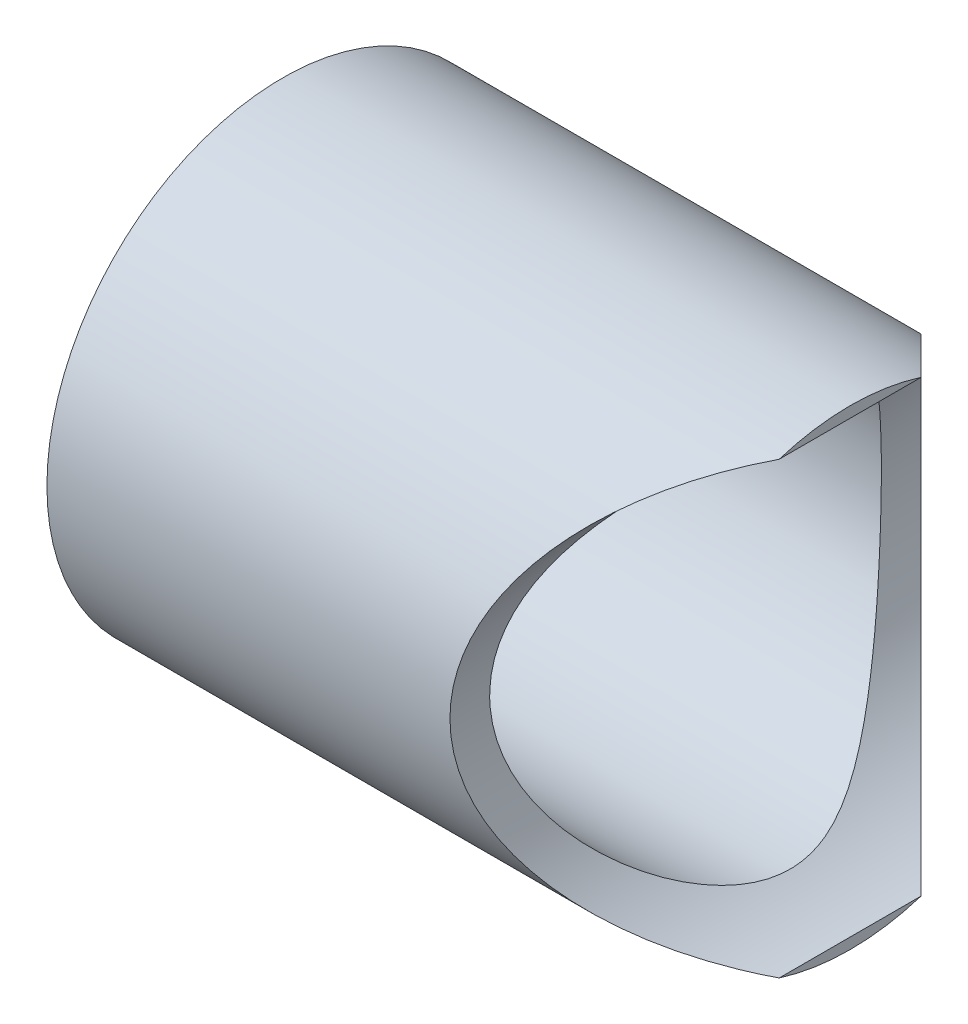
ISO-10303-21;
HEADER;
FILE_DESCRIPTION(('STEP AP214'),'2;1');
FILE_NAME('part.step','',(''),(''),'','','');
FILE_SCHEMA(('AUTOMOTIVE_DESIGN { 1 0 10303 214 1 1 1 1 }'));
ENDSEC;
DATA;
#1=APPLICATION_CONTEXT('core data for automotive mechanical design processes');
#2=APPLICATION_PROTOCOL_DEFINITION('international standard','automotive_design',2000,#1);
#3=PRODUCT_CONTEXT('',#1,'mechanical');
#4=PRODUCT('Part','Part','',(#3));
#5=PRODUCT_RELATED_PRODUCT_CATEGORY('part','',(#4));
#6=PRODUCT_DEFINITION_FORMATION('','',#4);
#7=PRODUCT_DEFINITION_CONTEXT('part definition',#1,'design');
#8=PRODUCT_DEFINITION('design','',#6,#7);
#9=PRODUCT_DEFINITION_SHAPE('','',#8);
#10=(LENGTH_UNIT() NAMED_UNIT(*) SI_UNIT(.MILLI.,.METRE.));
#11=(NAMED_UNIT(*) PLANE_ANGLE_UNIT() SI_UNIT($,.RADIAN.));
#12=(NAMED_UNIT(*) SI_UNIT($,.STERADIAN.) SOLID_ANGLE_UNIT());
#13=UNCERTAINTY_MEASURE_WITH_UNIT(LENGTH_MEASURE(1.E-05),#10,'distance_accuracy_value','');
#14=(GEOMETRIC_REPRESENTATION_CONTEXT(3) GLOBAL_UNCERTAINTY_ASSIGNED_CONTEXT((#13)) GLOBAL_UNIT_ASSIGNED_CONTEXT((#10,
#11,#12)) REPRESENTATION_CONTEXT('',''));
#15=CARTESIAN_POINT('',(0.,0.,0.));
#16=DIRECTION('',(0.,0.,1.));
#17=DIRECTION('',(1.,0.,0.));
#18=AXIS2_PLACEMENT_3D('',#15,#16,#17);
#19=CARTESIAN_POINT('',(568.325,28.575,31.75));
#20=DIRECTION('',(1.,0.,0.));
#21=DIRECTION('',(0.,0.,-1.));
#22=AXIS2_PLACEMENT_3D('',#19,#20,#21);
#23=CYLINDRICAL_SURFACE('',#22,17.526);
#24=CARTESIAN_POINT('',(517.525,28.575,31.75));
#25=DIRECTION('',(1.,0.,0.));
#26=DIRECTION('',(0.,0.,-1.));
#27=AXIS2_PLACEMENT_3D('',#24,#25,#26);
#28=CIRCLE('',#27,17.526);
#29=CARTESIAN_POINT('',(517.525,28.575,14.224));
#30=VERTEX_POINT('',#29);
#31=EDGE_CURVE('E50',#30,#30,#28,.F.);
#32=ORIENTED_EDGE('',*,*,#31,.T.);
#33=EDGE_LOOP('',(#32));
#34=FACE_BOUND('',#33,.T.);
#35=CARTESIAN_POINT('',(553.6132342657,27.651553554921,49.2516549780933));
#36=CARTESIAN_POINT('',(553.63194520487,27.2248883758585,49.2291386511275));
#37=CARTESIAN_POINT('',(553.663610725579,26.7995434640195,49.1910242975839));
#38=CARTESIAN_POINT('',(553.752104841597,25.9551538969348,49.0843120614281));
#39=CARTESIAN_POINT('',(553.808948425233,25.5361131483769,49.0156960212857));
#40=CARTESIAN_POINT('',(553.946600456313,24.7070400392876,48.8490849594317));
#41=CARTESIAN_POINT('',(554.027457627212,24.2970278321291,48.7510302022475));
#42=CARTESIAN_POINT('',(554.211300770934,23.4898151176844,48.527276357537));
#43=CARTESIAN_POINT('',(554.314283998306,23.0926130279163,48.4015806997103));
#44=CARTESIAN_POINT('',(554.539434674483,22.3162582315454,48.1255083294046));
#45=CARTESIAN_POINT('',(554.661447416689,21.9369895887925,47.9753302440843));
#46=CARTESIAN_POINT('',(554.92303896723,21.1949212814434,47.6515413924575));
#47=CARTESIAN_POINT('',(555.062617896931,20.8321217306566,47.4779304642516));
#48=CARTESIAN_POINT('',(555.357071377504,20.1242436265884,47.1091874654224));
#49=CARTESIAN_POINT('',(555.511942875587,19.7791615572673,46.9140596892073));
#50=CARTESIAN_POINT('',(555.834786549205,19.1073688486667,46.5039680266759));
#51=CARTESIAN_POINT('',(556.002761479555,18.780662097528,46.2889999674621));
#52=CARTESIAN_POINT('',(556.417437189112,18.0220383365813,45.7531298265484));
#53=CARTESIAN_POINT('',(556.669242607125,17.5989227834955,45.4236685216113));
#54=CARTESIAN_POINT('',(557.188161904108,16.7897380298934,44.7327405120847));
#55=CARTESIAN_POINT('',(557.455281581414,16.4036830113015,44.3712616562967));
#56=CARTESIAN_POINT('',(557.999542924498,15.6680400337881,43.6179753752106));
#57=CARTESIAN_POINT('',(558.276705238362,15.3185337076634,43.2261033255249));
#58=CARTESIAN_POINT('',(558.834279074004,14.6570525248326,42.4142205291842));
#59=CARTESIAN_POINT('',(559.11468983232,14.3450690379657,41.9942162875962));
#60=CARTESIAN_POINT('',(559.632011572531,13.8007185942458,41.1883641337813));
#61=CARTESIAN_POINT('',(559.869415567063,13.5633444865263,40.8062049143649));
#62=CARTESIAN_POINT('',(560.336291867032,13.1167833955921,40.0209297923646));
#63=CARTESIAN_POINT('',(560.565762786849,12.9076013181969,39.617810259254));
#64=CARTESIAN_POINT('',(561.009597244897,12.5190276239062,38.7909265661388));
#65=CARTESIAN_POINT('',(561.223997027915,12.3395630224724,38.3672163919916));
#66=CARTESIAN_POINT('',(561.629877023419,12.0116838635953,37.4974307300209));
#67=CARTESIAN_POINT('',(561.821372397404,11.8632487170933,37.0513703174964));
#68=CARTESIAN_POINT('',(562.10238022292,11.6517094609978,36.3158189708982));
#69=CARTESIAN_POINT('',(562.202466650341,11.5779501485683,36.0334054398798));
#70=CARTESIAN_POINT('',(562.387406449853,11.4437769399667,35.4605730507806));
#71=CARTESIAN_POINT('',(562.472265291171,11.3833582504955,35.1701571102972));
#72=CARTESIAN_POINT('',(562.623719926992,11.2768510445484,34.5826056062547));
#73=CARTESIAN_POINT('',(562.690351854318,11.2307341517171,34.2854846199364));
#74=CARTESIAN_POINT('',(562.802812907537,11.153559923682,33.6853537317127));
#75=CARTESIAN_POINT('',(562.848642594221,11.1225021825086,33.3823439887875));
#76=CARTESIAN_POINT('',(562.917618597342,11.0759576435487,32.7695518417688));
#77=CARTESIAN_POINT('',(562.940542440761,11.0606235246119,32.4597323258211));
#78=CARTESIAN_POINT('',(562.961686457704,11.0464752489036,31.8388774861906));
#79=CARTESIAN_POINT('',(562.959907912927,11.0476602350271,31.5278422264246));
#80=CARTESIAN_POINT('',(562.931737791119,11.066522239054,30.9071721607201));
#81=CARTESIAN_POINT('',(562.905327611075,11.0842117219626,30.5975385910324));
#82=CARTESIAN_POINT('',(562.829287785697,11.1356221445223,29.9824960146836));
#83=CARTESIAN_POINT('',(562.779654559099,11.1693455568054,29.6770876670826));
#84=CARTESIAN_POINT('',(562.648964561793,11.2593267827706,29.0192684622872));
#85=CARTESIAN_POINT('',(562.563912440033,11.3185077514551,28.6680552454522));
#86=CARTESIAN_POINT('',(562.369714116579,11.4564489198208,27.9763557783634));
#87=CARTESIAN_POINT('',(562.260561787034,11.5352140997343,27.6358722815128));
#88=CARTESIAN_POINT('',(562.022670875519,11.7110977346963,26.9656652776438));
#89=CARTESIAN_POINT('',(561.893879122912,11.8082661919802,26.6359740246218));
#90=CARTESIAN_POINT('',(561.621321691653,12.019578309619,25.9885187714624));
#91=CARTESIAN_POINT('',(561.477555053138,12.1337230583244,25.6707555376675));
#92=CARTESIAN_POINT('',(561.092030360477,12.4490441504447,24.8656000598379));
#93=CARTESIAN_POINT('',(560.841869054055,12.662255199984,24.3869171130996));
#94=CARTESIAN_POINT('',(560.325413057825,13.1263464140542,23.4572406747958));
#95=CARTESIAN_POINT('',(560.059109583728,13.3772472004749,23.0062625333938));
#96=CARTESIAN_POINT('',(559.519003931967,13.9157993131414,22.1305941430946));
#97=CARTESIAN_POINT('',(559.245192679099,14.2034968092985,21.7059379323097));
#98=CARTESIAN_POINT('',(558.697610994296,14.814832161151,20.883495621219));
#99=CARTESIAN_POINT('',(558.423840564891,15.1384629546108,20.4857042655945));
#100=CARTESIAN_POINT('',(557.872486123842,15.8341072768717,19.7036710781982));
#101=CARTESIAN_POINT('',(557.595127555098,16.2074554775149,19.3204535192804));
#102=CARTESIAN_POINT('',(557.053147217793,16.9927394643263,18.5856108378869));
#103=CARTESIAN_POINT('',(556.78852764483,17.4046818665104,18.2339911523956));
#104=CARTESIAN_POINT('',(556.278735946374,18.2658875770049,17.566247661421));
#105=CARTESIAN_POINT('',(556.033518005512,18.7150575018147,17.2500394528144));
#106=CARTESIAN_POINT('',(555.684541741303,19.4163188768659,16.8049043481796));
#107=CARTESIAN_POINT('',(555.571372631905,19.6546217657447,16.6614069120782));
#108=CARTESIAN_POINT('',(555.352015446805,20.1403100336688,16.384622710406));
#109=CARTESIAN_POINT('',(555.245829019299,20.387697535729,16.2513383543187));
#110=CARTESIAN_POINT('',(555.000724302809,20.9909703069177,15.9449832838891));
#111=CARTESIAN_POINT('',(554.865504638994,21.3510115435203,15.7770694459881));
#112=CARTESIAN_POINT('',(554.612468644417,22.0867901817555,15.464314302072));
#113=CARTESIAN_POINT('',(554.494647792276,22.4625234728666,15.319467001054));
#114=CARTESIAN_POINT('',(554.278486111934,23.2279462607528,15.0546840261331));
#115=CARTESIAN_POINT('',(554.180136041326,23.6176290317467,14.93473653145));
#116=CARTESIAN_POINT('',(554.004758658889,24.4089395054123,14.7214205670362));
#117=CARTESIAN_POINT('',(553.927731902221,24.8105675187823,14.6280527893188));
#118=CARTESIAN_POINT('',(553.796242064935,25.6255022994865,14.4689553147246));
#119=CARTESIAN_POINT('',(553.741917605387,26.0388648166705,14.4033953782027));
#120=CARTESIAN_POINT('',(553.657753481508,26.8717012490999,14.3019225005657));
#121=CARTESIAN_POINT('',(553.62791377489,27.2911751537893,14.2660095082485));
#122=CARTESIAN_POINT('',(553.593438891844,28.1325659071852,14.2245241417152));
#123=CARTESIAN_POINT('',(553.588798137691,28.5544821945765,14.2189450531651));
#124=CARTESIAN_POINT('',(553.604822338428,29.3971171081654,14.238221976866));
#125=CARTESIAN_POINT('',(553.62548566314,29.8178358097656,14.2630760285077));
#126=CARTESIAN_POINT('',(553.688561885376,30.6159230296238,14.3390570919547));
#127=CARTESIAN_POINT('',(553.728799395593,30.9937194250997,14.3875571914303));
#128=CARTESIAN_POINT('',(553.828929712951,31.7427812450289,14.5084876261824));
#129=CARTESIAN_POINT('',(553.888821064225,32.1140471510855,14.5809161889501));
#130=CARTESIAN_POINT('',(554.027171891085,32.8478640262592,14.7486763247663));
#131=CARTESIAN_POINT('',(554.105633783347,33.21041385434,14.8440108787088));
#132=CARTESIAN_POINT('',(554.279783315149,33.9248674991795,15.0563334639198));
#133=CARTESIAN_POINT('',(554.375471946737,34.2767707014591,15.1733227422459));
#134=CARTESIAN_POINT('',(554.587686804472,34.9854655883075,15.4338700258972));
#135=CARTESIAN_POINT('',(554.705008685464,35.3416405381561,15.5784547566227));
#136=CARTESIAN_POINT('',(554.955115211802,36.0391932726221,15.8883425772297));
#137=CARTESIAN_POINT('',(555.087899920564,36.3805709965455,16.0536457520818));
#138=CARTESIAN_POINT('',(555.367046494505,37.0475647296724,16.4034001140339));
#139=CARTESIAN_POINT('',(555.513408197233,37.3731809273932,16.5878510720319));
#140=CARTESIAN_POINT('',(555.817842140174,38.0080442128939,16.9744614103544));
#141=CARTESIAN_POINT('',(555.975916710006,38.3172880232222,17.1766243149436));
#142=CARTESIAN_POINT('',(556.378205331234,39.0597598160948,17.6957887790924));
#143=CARTESIAN_POINT('',(556.628123801946,39.4833160904538,18.0222722641879));
#144=CARTESIAN_POINT('',(557.143476858452,40.293667724244,18.707178477193));
#145=CARTESIAN_POINT('',(557.408917656656,40.6804482002274,19.065614023602));
#146=CARTESIAN_POINT('',(557.950651241676,41.4185696710951,19.8134758321493));
#147=CARTESIAN_POINT('',(558.226985186979,41.7697538179874,20.2030267848256));
#148=CARTESIAN_POINT('',(558.783282553626,42.4347211063088,21.0102486787129));
#149=CARTESIAN_POINT('',(559.063245346979,42.7485106257462,21.4279148055433));
#150=CARTESIAN_POINT('',(559.625039046534,43.3438829297906,22.2988544801849));
#151=CARTESIAN_POINT('',(559.906811272405,43.6247758999827,22.7526376007069));
#152=CARTESIAN_POINT('',(560.458476862686,44.1469381906453,23.6900082577224));
#153=CARTESIAN_POINT('',(560.728363228186,44.3881843878375,24.1736129626194));
#154=CARTESIAN_POINT('',(561.11459737276,44.7179489663259,24.9207034971405));
#155=CARTESIAN_POINT('',(561.239928719899,44.8222804520434,25.1726371069145));
#156=CARTESIAN_POINT('',(561.482889061811,45.0201661238956,25.6843157565484));
#157=CARTESIAN_POINT('',(561.600517366609,45.113719345169,25.9440614931227));
#158=CARTESIAN_POINT('',(561.938532613595,45.3772129267124,26.7345969811832));
#159=CARTESIAN_POINT('',(562.144573565655,45.5304248798187,27.2776663439232));
#160=CARTESIAN_POINT('',(562.408721562727,45.7214547675609,28.1113403675845));
#161=CARTESIAN_POINT('',(562.488946350962,45.7784454842204,28.3907307055577));
#162=CARTESIAN_POINT('',(562.632545549384,45.8792680200227,28.9561877305163));
#163=CARTESIAN_POINT('',(562.695922688387,45.9231019703183,29.2422533281339));
#164=CARTESIAN_POINT('',(562.803266107254,45.9967369819232,29.8191654017346));
#165=CARTESIAN_POINT('',(562.847274457066,46.0265684667391,30.1100000784278));
#166=CARTESIAN_POINT('',(562.914128823784,46.0716933051478,30.6952451785392));
#167=CARTESIAN_POINT('',(562.936975128598,46.0869868565273,30.9896555532553));
#168=CARTESIAN_POINT('',(562.960445793863,46.1026967996271,31.5812183700857));
#169=CARTESIAN_POINT('',(562.960960707175,46.1030399186543,31.8783771794665));
#170=CARTESIAN_POINT('',(562.939466250044,46.0886555348839,32.4714956001306));
#171=CARTESIAN_POINT('',(562.917457043358,46.073928141653,32.7674552201168));
#172=CARTESIAN_POINT('',(562.8519492719,46.0297340043308,33.3563219911474));
#173=CARTESIAN_POINT('',(562.808416441744,46.000243756991,33.6492235120187));
#174=CARTESIAN_POINT('',(562.701813002513,45.9271660927923,34.2296425693816));
#175=CARTESIAN_POINT('',(562.638739242296,45.8835764022277,34.5171592295828));
#176=CARTESIAN_POINT('',(562.471450550931,45.7662113088861,35.1809636469716));
#177=CARTESIAN_POINT('',(562.360532700913,45.6872147996494,35.5546411138733));
#178=CARTESIAN_POINT('',(562.114425943304,45.5073914325158,36.2884692554274));
#179=CARTESIAN_POINT('',(561.979227088422,45.4065556241319,36.6486143128119));
#180=CARTESIAN_POINT('',(561.689935243357,45.1843993979503,37.3559195827519));
#181=CARTESIAN_POINT('',(561.535789433679,45.0630213418557,37.7030398056629));
#182=CARTESIAN_POINT('',(561.213859888931,44.8012605524443,38.3833998872504));
#183=CARTESIAN_POINT('',(561.04607611074,44.6608777590383,38.7166397020355));
#184=CARTESIAN_POINT('',(560.608888433648,44.2822431140732,39.5440181955595));
#185=CARTESIAN_POINT('',(560.333019323547,44.0317302471892,40.0291637236577));
#186=CARTESIAN_POINT('',(559.770344380904,43.4899203781355,40.9695660105658));
#187=CARTESIAN_POINT('',(559.483533061258,43.1986027129857,41.42480745372));
#188=CARTESIAN_POINT('',(558.907928237572,42.5760680707156,42.3056380817098));
#189=CARTESIAN_POINT('',(558.619135115743,42.2448585939066,42.7312328169331));
#190=CARTESIAN_POINT('',(558.046944152441,41.5427881044085,43.5520611165452));
#191=CARTESIAN_POINT('',(557.763544552722,41.1719402836909,43.9473047072588));
#192=CARTESIAN_POINT('',(557.250932347177,40.4500855223073,44.6479050542139));
#193=CARTESIAN_POINT('',(557.020039517338,40.104655606259,44.9577848113518));
#194=CARTESIAN_POINT('',(556.570674961482,39.385362187291,45.5527003561298));
#195=CARTESIAN_POINT('',(556.352203425436,39.011498249711,45.8377357638405));
#196=CARTESIAN_POINT('',(555.931854101961,38.236233086218,46.3802707735649));
#197=CARTESIAN_POINT('',(555.72995716844,37.8348646445538,46.6378022531986));
#198=CARTESIAN_POINT('',(555.346483507056,37.0051764153914,47.1228182191359));
#199=CARTESIAN_POINT('',(555.164901539806,36.5768636217786,47.350310455535));
#200=CARTESIAN_POINT('',(554.859167605639,35.7811124675231,47.730843087028));
#201=CARTESIAN_POINT('',(554.730724938503,35.4181178398956,47.8897474704416));
#202=CARTESIAN_POINT('',(554.491683681334,34.6771247635223,48.1842206324834));
#203=CARTESIAN_POINT('',(554.381081327874,34.29912950019,48.3197943331404));
#204=CARTESIAN_POINT('',(554.179872499111,33.5305993738711,48.5656230781489));
#205=CARTESIAN_POINT('',(554.089229606597,33.140088862956,48.6759242488807));
#206=CARTESIAN_POINT('',(553.929502635769,32.3483283527259,48.8698317633875));
#207=CARTESIAN_POINT('',(553.860407994454,31.9470837203728,48.9534511870818));
#208=CARTESIAN_POINT('',(553.754934175882,31.2050818274989,49.0809015698988));
#209=CARTESIAN_POINT('',(553.714999015169,30.8655660207117,49.1290691186784));
#210=CARTESIAN_POINT('',(553.651619441307,30.1829683550343,49.2054559078416));
#211=CARTESIAN_POINT('',(553.628164234457,29.8398889798614,49.2336882050672));
#212=CARTESIAN_POINT('',(553.599707448171,29.189094492885,49.2679332439178));
#213=CARTESIAN_POINT('',(553.592986695636,28.8815610323838,49.276016110476));
#214=CARTESIAN_POINT('',(553.593013357231,28.2663083269467,49.2759838258614));
#215=CARTESIAN_POINT('',(553.599769554887,27.9585890916039,49.2678581108385));
#216=CARTESIAN_POINT('',(553.6132342657,27.651553554921,49.2516549780933));
#217=B_SPLINE_CURVE_WITH_KNOTS('',3,(#35,#36,#37,#38,#39,#40,#41,#42,#43,#44,#45,#46,#47,#48,
#49,#50,#51,#52,#53,#54,#55,#56,#57,#58,#59,#60,#61,#62,#63,#64,#65,#66,#67,#68,#69,#70,#71,#72,
#73,#74,#75,#76,#77,#78,#79,#80,#81,#82,#83,#84,#85,#86,#87,#88,#89,#90,#91,#92,#93,#94,#95,#96,
#97,#98,#99,#100,#101,#102,#103,#104,#105,#106,#107,#108,#109,#110,#111,#112,#113,#114,#115,
#116,#117,#118,#119,#120,#121,#122,#123,#124,#125,#126,#127,#128,#129,#130,#131,#132,#133,#134,
#135,#136,#137,#138,#139,#140,#141,#142,#143,#144,#145,#146,#147,#148,#149,#150,#151,#152,#153,
#154,#155,#156,#157,#158,#159,#160,#161,#162,#163,#164,#165,#166,#167,#168,#169,#170,#171,#172,
#173,#174,#175,#176,#177,#178,#179,#180,#181,#182,#183,#184,#185,#186,#187,#188,#189,#190,#191,
#192,#193,#194,#195,#196,#197,#198,#199,#200,#201,#202,#203,#204,#205,#206,#207,#208,#209,#210,
#211,#212,#213,#214,#215,#216),.UNSPECIFIED.,.T.,.F.,(4,2,2,2,2,2,2,2,2,2,2,2,2,2,2,2,2,2,2,2,2,
2,2,2,2,2,2,2,2,2,2,2,2,2,2,2,2,2,2,2,2,2,2,2,2,2,2,2,2,2,2,2,2,2,2,2,2,2,2,2,2,2,2,2,2,2,2,2,2,
2,2,2,2,2,2,2,2,2,2,2,2,2,2,2,2,2,2,2,2,2,4),(0.,1.28266050777424,2.56608560281959,
3.8521327620706,5.1380204377683,6.41395217147341,7.68989272114423,8.96557907346175,
10.2415343479696,12.0163152153016,13.7917725517059,15.5711143417814,17.3500461018275,
18.8749141189754,20.4000471434568,21.9213771095543,23.4416943966374,24.3667627277754,
25.2914981381263,26.214386855137,27.1372506912266,28.0689931711587,29.0006873071831,
29.9330856743919,30.8656278757262,31.9624477123942,33.0595467542928,34.1596705566527,
35.2598649184047,36.9992682209351,38.7396267257288,40.4821907343899,42.2244128683107,
44.0302161974645,45.8363296550886,47.6380422599452,48.5386462094738,49.4394619806558,
50.6971535136804,51.9545176367694,53.2112834745756,54.4680820297836,55.7324463122807,
56.996808411133,58.2608906351887,59.5248914269273,60.6726272861738,61.8202781455651,
62.9680784366185,64.1159448480606,65.3204949282405,66.5250499486882,67.7295905583748,
68.9343713902953,70.702730957428,72.4718031739328,74.2483594050642,76.0246121926999,
77.8331810633499,79.6428010348139,80.5427553506985,81.442790167245,83.2392899850788,
84.127268114604,85.0151023303732,85.9009984938411,86.7868826046349,87.6771079845615,
88.5673268923579,89.45896760494,90.350752177117,91.5419875327469,92.7337120240663,
93.928837491237,95.1239667372425,96.9566067383892,98.7901781406281,100.623405338124,
102.456024310901,104.009597063075,105.563193568914,107.114969422952,108.666344134808,
109.914797114956,111.162986387647,112.4088790398,113.654159989084,114.688924306113,
115.72301026111,116.645433249095,117.56845761741),.UNSPECIFIED.);
#218=CARTESIAN_POINT('',(553.6132342657,27.651553554921,49.2516549780933));
#219=VERTEX_POINT('',#218);
#220=EDGE_CURVE('E18',#219,#219,#217,.T.);
#221=ORIENTED_EDGE('',*,*,#220,.T.);
#222=EDGE_LOOP('',(#221));
#223=FACE_BOUND('',#222,.T.);
#224=ADVANCED_FACE('F14',(#34,#223),#23,.F.);
#225=CARTESIAN_POINT('',(568.325,28.5749999999996,993.775));
#226=DIRECTION('',(1.,0.,0.));
#227=DIRECTION('',(0.,0.,-1.));
#228=AXIS2_PLACEMENT_3D('',#225,#226,#227);
#229=PLANE('',#228);
#230=DIRECTION('',(0.,0.,1.));
#231=VECTOR('',#230,1.);
#232=CARTESIAN_POINT('',(568.325,8.47205931959209,76.2));
#233=LINE('',#232,#231);
#234=CARTESIAN_POINT('',(568.325,8.47205931959209,25.4000000000002));
#235=VERTEX_POINT('',#234);
#236=CARTESIAN_POINT('',(568.325,8.4720593195921,38.1000000000001));
#237=VERTEX_POINT('',#236);
#238=EDGE_CURVE('E45',#235,#237,#233,.T.);
#239=ORIENTED_EDGE('',*,*,#238,.T.);
#240=CARTESIAN_POINT('',(568.325,28.575,31.75));
#241=DIRECTION('',(1.,0.,0.));
#242=DIRECTION('',(0.,0.,-1.));
#243=AXIS2_PLACEMENT_3D('',#240,#241,#242);
#244=CIRCLE('',#243,21.082);
#245=EDGE_CURVE('E43',#235,#237,#244,.F.);
#246=ORIENTED_EDGE('',*,*,#245,.F.);
#247=EDGE_LOOP('',(#239,#246));
#248=FACE_BOUND('',#247,.T.);
#249=ADVANCED_FACE('F47',(#248),#229,.T.);
#250=CARTESIAN_POINT('',(568.325,28.5749999999996,993.775));
#251=DIRECTION('',(1.,0.,0.));
#252=DIRECTION('',(0.,0.,-1.));
#253=AXIS2_PLACEMENT_3D('',#250,#251,#252);
#254=PLANE('',#253);
#255=DIRECTION('',(0.,0.,1.));
#256=VECTOR('',#255,1.);
#257=CARTESIAN_POINT('',(568.325,48.6779406804078,76.2));
#258=LINE('',#257,#256);
#259=CARTESIAN_POINT('',(568.325,48.6779406804078,38.1000000000005));
#260=VERTEX_POINT('',#259);
#261=CARTESIAN_POINT('',(568.325,48.6779406804078,25.4000000000003));
#262=VERTEX_POINT('',#261);
#263=EDGE_CURVE('E35',#260,#262,#258,.F.);
#264=ORIENTED_EDGE('',*,*,#263,.T.);
#265=CARTESIAN_POINT('',(568.325,28.575,31.75));
#266=DIRECTION('',(1.,0.,0.));
#267=DIRECTION('',(0.,0.,-1.));
#268=AXIS2_PLACEMENT_3D('',#265,#266,#267);
#269=CIRCLE('',#268,21.082);
#270=EDGE_CURVE('E58',#260,#262,#269,.F.);
#271=ORIENTED_EDGE('',*,*,#270,.F.);
#272=EDGE_LOOP('',(#264,#271));
#273=FACE_BOUND('',#272,.T.);
#274=ADVANCED_FACE('F71',(#273),#254,.T.);
#275=CARTESIAN_POINT('',(574.675,28.575,76.2));
#276=DIRECTION('',(0.,0.,1.));
#277=DIRECTION('',(1.,0.,0.));
#278=AXIS2_PLACEMENT_3D('',#275,#276,#277);
#279=CYLINDRICAL_SURFACE('',#278,21.082);
#280=CARTESIAN_POINT('',(574.675,28.575,31.75));
#281=DIRECTION('',(-0.707106781186547,0.,0.707106781186547));
#282=DIRECTION('',(0.707106781186547,0.,0.707106781186547));
#283=AXIS2_PLACEMENT_3D('',#280,#281,#282);
#284=ELLIPSE('',#283,29.8144503219496,21.082);
#285=EDGE_CURVE('E27',#262,#235,#284,.T.);
#286=ORIENTED_EDGE('',*,*,#285,.F.);
#287=ORIENTED_EDGE('',*,*,#263,.F.);
#288=CARTESIAN_POINT('',(574.675,28.575,31.75));
#289=DIRECTION('',(0.707106781186547,0.,0.707106781186547));
#290=DIRECTION('',(-0.707106781186547,0.,0.707106781186547));
#291=AXIS2_PLACEMENT_3D('',#288,#289,#290);
#292=ELLIPSE('',#291,29.8144503219496,21.082);
#293=EDGE_CURVE('E53',#237,#260,#292,.F.);
#294=ORIENTED_EDGE('',*,*,#293,.F.);
#295=ORIENTED_EDGE('',*,*,#238,.F.);
#296=EDGE_LOOP('',(#286,#287,#294,#295));
#297=FACE_BOUND('',#296,.T.);
#298=ORIENTED_EDGE('',*,*,#220,.F.);
#299=EDGE_LOOP('',(#298));
#300=FACE_BOUND('',#299,.T.);
#301=ADVANCED_FACE('F54',(#297,#300),#279,.F.);
#302=CARTESIAN_POINT('',(517.525,28.5749999999996,993.775));
#303=DIRECTION('',(1.,0.,0.));
#304=DIRECTION('',(0.,0.,-1.));
#305=AXIS2_PLACEMENT_3D('',#302,#303,#304);
#306=PLANE('',#305);
#307=CARTESIAN_POINT('',(517.525,28.575,31.75));
#308=DIRECTION('',(1.,0.,0.));
#309=DIRECTION('',(0.,0.,-1.));
#310=AXIS2_PLACEMENT_3D('',#307,#308,#309);
#311=CIRCLE('',#310,21.082);
#312=CARTESIAN_POINT('',(517.525,28.575,10.668));
#313=VERTEX_POINT('',#312);
#314=EDGE_CURVE('E9',#313,#313,#311,.T.);
#315=ORIENTED_EDGE('',*,*,#314,.F.);
#316=EDGE_LOOP('',(#315));
#317=FACE_BOUND('',#316,.T.);
#318=ORIENTED_EDGE('',*,*,#31,.F.);
#319=EDGE_LOOP('',(#318));
#320=FACE_BOUND('',#319,.T.);
#321=ADVANCED_FACE('F70',(#317,#320),#306,.F.);
#322=CARTESIAN_POINT('',(568.325,28.575,31.75));
#323=DIRECTION('',(1.,0.,0.));
#324=DIRECTION('',(0.,0.,-1.));
#325=AXIS2_PLACEMENT_3D('',#322,#323,#324);
#326=CYLINDRICAL_SURFACE('',#325,21.082);
#327=ORIENTED_EDGE('',*,*,#314,.T.);
#328=EDGE_LOOP('',(#327));
#329=FACE_BOUND('',#328,.T.);
#330=ORIENTED_EDGE('',*,*,#270,.T.);
#331=ORIENTED_EDGE('',*,*,#285,.T.);
#332=ORIENTED_EDGE('',*,*,#245,.T.);
#333=ORIENTED_EDGE('',*,*,#293,.T.);
#334=EDGE_LOOP('',(#330,#331,#332,#333));
#335=FACE_BOUND('',#334,.T.);
#336=ADVANCED_FACE('F60',(#329,#335),#326,.T.);
#337=CLOSED_SHELL('',(#224,#249,#274,#301,#321,#336));
#338=MANIFOLD_SOLID_BREP('B1',#337);
#339=ADVANCED_BREP_SHAPE_REPRESENTATION('',(#18,#338),#14);
#340=SHAPE_DEFINITION_REPRESENTATION(#9,#339);
ENDSEC;
END-ISO-10303-21;
